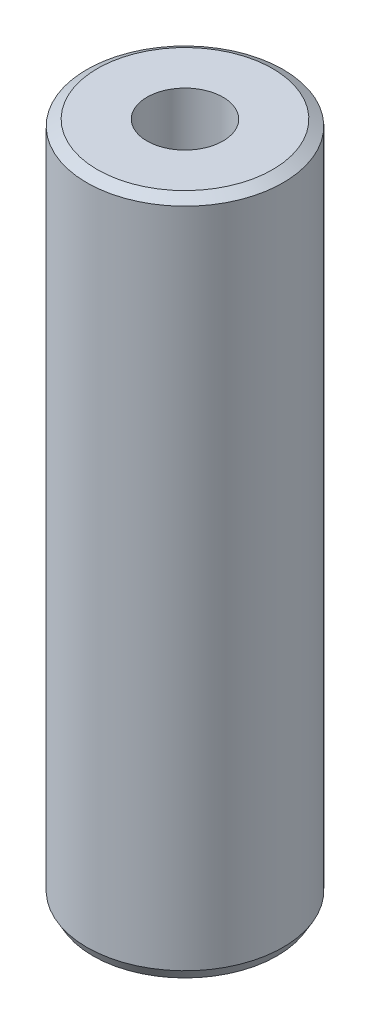
ISO-10303-21;
HEADER;
FILE_DESCRIPTION(('STEP AP214'),'2;1');
FILE_NAME('part.step','',(''),(''),'','','');
FILE_SCHEMA(('AUTOMOTIVE_DESIGN { 1 0 10303 214 1 1 1 1 }'));
ENDSEC;
DATA;
#1=APPLICATION_CONTEXT('core data for automotive mechanical design processes');
#2=APPLICATION_PROTOCOL_DEFINITION('international standard','automotive_design',2000,#1);
#3=PRODUCT_CONTEXT('',#1,'mechanical');
#4=PRODUCT('Part','Part','',(#3));
#5=PRODUCT_RELATED_PRODUCT_CATEGORY('part','',(#4));
#6=PRODUCT_DEFINITION_FORMATION('','',#4);
#7=PRODUCT_DEFINITION_CONTEXT('part definition',#1,'design');
#8=PRODUCT_DEFINITION('design','',#6,#7);
#9=PRODUCT_DEFINITION_SHAPE('','',#8);
#10=(LENGTH_UNIT() NAMED_UNIT(*) SI_UNIT(.MILLI.,.METRE.));
#11=(NAMED_UNIT(*) PLANE_ANGLE_UNIT() SI_UNIT($,.RADIAN.));
#12=(NAMED_UNIT(*) SI_UNIT($,.STERADIAN.) SOLID_ANGLE_UNIT());
#13=UNCERTAINTY_MEASURE_WITH_UNIT(LENGTH_MEASURE(1.E-05),#10,'distance_accuracy_value','');
#14=(GEOMETRIC_REPRESENTATION_CONTEXT(3) GLOBAL_UNCERTAINTY_ASSIGNED_CONTEXT((#13)) GLOBAL_UNIT_ASSIGNED_CONTEXT((#10,
#11,#12)) REPRESENTATION_CONTEXT('',''));
#15=CARTESIAN_POINT('',(0.,0.,0.));
#16=DIRECTION('',(0.,0.,1.));
#17=DIRECTION('',(1.,0.,0.));
#18=AXIS2_PLACEMENT_3D('',#15,#16,#17);
#19=CARTESIAN_POINT('',(0.,276.613206114339,0.));
#20=DIRECTION('',(0.,-1.,0.));
#21=DIRECTION('',(0.,0.,-1.));
#22=AXIS2_PLACEMENT_3D('',#19,#20,#21);
#23=CYLINDRICAL_SURFACE('',#22,40.);
#24=CARTESIAN_POINT('',(0.,274.134053556619,0.));
#25=DIRECTION('',(0.,1.,0.));
#26=DIRECTION('',(0.,0.,1.));
#27=AXIS2_PLACEMENT_3D('',#24,#25,#26);
#28=CIRCLE('',#27,40.);
#29=CARTESIAN_POINT('',(0.,274.134053556619,40.));
#30=VERTEX_POINT('',#29);
#31=EDGE_CURVE('E50',#30,#30,#28,.F.);
#32=ORIENTED_EDGE('',*,*,#31,.T.);
#33=EDGE_LOOP('',(#32));
#34=FACE_BOUND('',#33,.T.);
#35=CARTESIAN_POINT('',(0.,4.29401818968433,0.));
#36=DIRECTION('',(0.,1.,0.));
#37=DIRECTION('',(0.,0.,1.));
#38=AXIS2_PLACEMENT_3D('',#35,#36,#37);
#39=CIRCLE('',#38,40.);
#40=CARTESIAN_POINT('',(0.,4.29401818968433,40.));
#41=VERTEX_POINT('',#40);
#42=EDGE_CURVE('E51',#41,#41,#39,.T.);
#43=ORIENTED_EDGE('',*,*,#42,.T.);
#44=EDGE_LOOP('',(#43));
#45=FACE_BOUND('',#44,.T.);
#46=ADVANCED_FACE('F39',(#34,#45),#23,.T.);
#47=CARTESIAN_POINT('',(0.,276.613206114339,0.));
#48=DIRECTION('',(0.,1.,0.));
#49=DIRECTION('',(0.,0.,1.));
#50=AXIS2_PLACEMENT_3D('',#47,#48,#49);
#51=PLANE('',#50);
#52=CARTESIAN_POINT('',(0.,276.613206114339,0.));
#53=DIRECTION('',(0.,1.,0.));
#54=DIRECTION('',(0.,0.,1.));
#55=AXIS2_PLACEMENT_3D('',#52,#53,#54);
#56=CIRCLE('',#55,35.7059818103155);
#57=CARTESIAN_POINT('',(0.,276.613206114339,35.7059818103155));
#58=VERTEX_POINT('',#57);
#59=EDGE_CURVE('E54',#58,#58,#56,.T.);
#60=ORIENTED_EDGE('',*,*,#59,.T.);
#61=EDGE_LOOP('',(#60));
#62=FACE_BOUND('',#61,.T.);
#63=CARTESIAN_POINT('',(0.,276.613206114339,0.));
#64=DIRECTION('',(0.,1.,0.));
#65=DIRECTION('',(0.,0.,1.));
#66=AXIS2_PLACEMENT_3D('',#63,#64,#65);
#67=CIRCLE('',#66,15.4937900656822);
#68=CARTESIAN_POINT('',(0.,276.613206114339,15.4937900656822));
#69=VERTEX_POINT('',#68);
#70=EDGE_CURVE('E58',#69,#69,#67,.T.);
#71=ORIENTED_EDGE('',*,*,#70,.F.);
#72=EDGE_LOOP('',(#71));
#73=FACE_BOUND('',#72,.T.);
#74=ADVANCED_FACE('F69',(#62,#73),#51,.T.);
#75=CARTESIAN_POINT('',(0.,0.,0.));
#76=DIRECTION('',(0.,1.,0.));
#77=DIRECTION('',(0.,0.,1.));
#78=AXIS2_PLACEMENT_3D('',#75,#76,#77);
#79=PLANE('',#78);
#80=CARTESIAN_POINT('',(0.,0.,0.));
#81=DIRECTION('',(0.,1.,0.));
#82=DIRECTION('',(0.,0.,1.));
#83=AXIS2_PLACEMENT_3D('',#80,#81,#82);
#84=CIRCLE('',#83,37.5208474422806);
#85=CARTESIAN_POINT('',(0.,0.,37.5208474422806));
#86=VERTEX_POINT('',#85);
#87=EDGE_CURVE('E10',#86,#86,#84,.F.);
#88=ORIENTED_EDGE('',*,*,#87,.T.);
#89=EDGE_LOOP('',(#88));
#90=FACE_BOUND('',#89,.T.);
#91=CARTESIAN_POINT('',(0.,0.,0.));
#92=DIRECTION('',(0.,1.,0.));
#93=DIRECTION('',(0.,0.,1.));
#94=AXIS2_PLACEMENT_3D('',#91,#92,#93);
#95=CIRCLE('',#94,15.4937900656822);
#96=CARTESIAN_POINT('',(0.,0.,15.4937900656822));
#97=VERTEX_POINT('',#96);
#98=EDGE_CURVE('E63',#97,#97,#95,.T.);
#99=ORIENTED_EDGE('',*,*,#98,.T.);
#100=EDGE_LOOP('',(#99));
#101=FACE_BOUND('',#100,.T.);
#102=ADVANCED_FACE('F75',(#90,#101),#79,.F.);
#103=CARTESIAN_POINT('',(0.,276.613206114339,0.));
#104=DIRECTION('',(0.,-1.,0.));
#105=DIRECTION('',(0.,0.,-1.));
#106=AXIS2_PLACEMENT_3D('',#103,#104,#105);
#107=CYLINDRICAL_SURFACE('',#106,15.4937900656822);
#108=ORIENTED_EDGE('',*,*,#70,.T.);
#109=EDGE_LOOP('',(#108));
#110=FACE_BOUND('',#109,.T.);
#111=ORIENTED_EDGE('',*,*,#98,.F.);
#112=EDGE_LOOP('',(#111));
#113=FACE_BOUND('',#112,.T.);
#114=ADVANCED_FACE('F70',(#110,#113),#107,.F.);
#115=CARTESIAN_POINT('',(0.,276.613206114339,0.));
#116=DIRECTION('',(0.,-1.,0.));
#117=DIRECTION('',(0.,0.,-1.));
#118=AXIS2_PLACEMENT_3D('',#115,#116,#117);
#119=CONICAL_SURFACE('',#118,35.7059818103155,1.04719755119659);
#120=ORIENTED_EDGE('',*,*,#31,.F.);
#121=EDGE_LOOP('',(#120));
#122=FACE_BOUND('',#121,.T.);
#123=ORIENTED_EDGE('',*,*,#59,.F.);
#124=EDGE_LOOP('',(#123));
#125=FACE_BOUND('',#124,.T.);
#126=ADVANCED_FACE('F81',(#122,#125),#119,.T.);
#127=CARTESIAN_POINT('',(0.,4.29401818968433,0.));
#128=DIRECTION('',(0.,1.,0.));
#129=DIRECTION('',(0.,0.,1.));
#130=AXIS2_PLACEMENT_3D('',#127,#128,#129);
#131=CONICAL_SURFACE('',#130,40.,0.523598775598304);
#132=ORIENTED_EDGE('',*,*,#87,.F.);
#133=EDGE_LOOP('',(#132));
#134=FACE_BOUND('',#133,.T.);
#135=ORIENTED_EDGE('',*,*,#42,.F.);
#136=EDGE_LOOP('',(#135));
#137=FACE_BOUND('',#136,.T.);
#138=ADVANCED_FACE('F45',(#134,#137),#131,.T.);
#139=CLOSED_SHELL('',(#46,#74,#102,#114,#126,#138));
#140=MANIFOLD_SOLID_BREP('B2',#139);
#141=ADVANCED_BREP_SHAPE_REPRESENTATION('',(#18,#140),#14);
#142=SHAPE_DEFINITION_REPRESENTATION(#9,#141);
ENDSEC;
END-ISO-10303-21;
